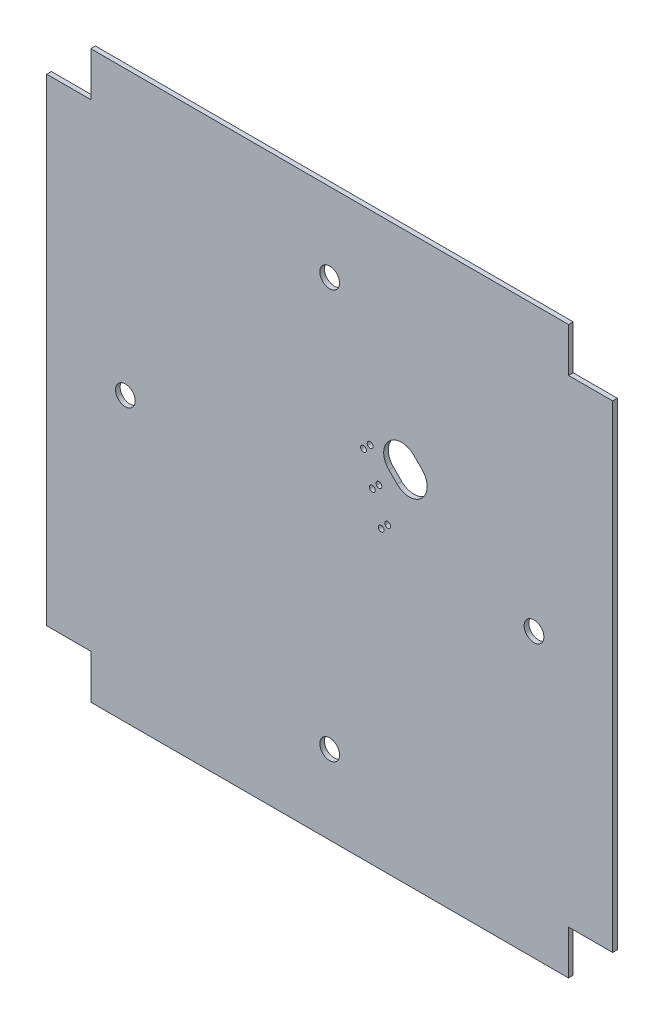
ISO-10303-21;
HEADER;
FILE_DESCRIPTION(('STEP AP214'),'2;1');
FILE_NAME('part.step','',(''),(''),'','','');
FILE_SCHEMA(('AUTOMOTIVE_DESIGN { 1 0 10303 214 1 1 1 1 }'));
ENDSEC;
DATA;
#1=APPLICATION_CONTEXT('core data for automotive mechanical design processes');
#2=APPLICATION_PROTOCOL_DEFINITION('international standard','automotive_design',2000,#1);
#3=PRODUCT_CONTEXT('',#1,'mechanical');
#4=PRODUCT('Part','Part','',(#3));
#5=PRODUCT_RELATED_PRODUCT_CATEGORY('part','',(#4));
#6=PRODUCT_DEFINITION_FORMATION('','',#4);
#7=PRODUCT_DEFINITION_CONTEXT('part definition',#1,'design');
#8=PRODUCT_DEFINITION('design','',#6,#7);
#9=PRODUCT_DEFINITION_SHAPE('','',#8);
#10=(LENGTH_UNIT() NAMED_UNIT(*) SI_UNIT(.MILLI.,.METRE.));
#11=(NAMED_UNIT(*) PLANE_ANGLE_UNIT() SI_UNIT($,.RADIAN.));
#12=(NAMED_UNIT(*) SI_UNIT($,.STERADIAN.) SOLID_ANGLE_UNIT());
#13=UNCERTAINTY_MEASURE_WITH_UNIT(LENGTH_MEASURE(1.E-05),#10,'distance_accuracy_value','');
#14=(GEOMETRIC_REPRESENTATION_CONTEXT(3) GLOBAL_UNCERTAINTY_ASSIGNED_CONTEXT((#13)) GLOBAL_UNIT_ASSIGNED_CONTEXT((#10,
#11,#12)) REPRESENTATION_CONTEXT('',''));
#15=CARTESIAN_POINT('',(0.,0.,0.));
#16=DIRECTION('',(0.,0.,1.));
#17=DIRECTION('',(1.,0.,0.));
#18=AXIS2_PLACEMENT_3D('',#15,#16,#17);
#19=CARTESIAN_POINT('',(48.75,48.75,0.8));
#20=DIRECTION('',(0.,-1.,0.));
#21=DIRECTION('',(1.,0.,0.));
#22=AXIS2_PLACEMENT_3D('',#19,#20,#21);
#23=PLANE('',#22);
#24=DIRECTION('',(-1.,0.,0.));
#25=VECTOR('',#24,1.);
#26=CARTESIAN_POINT('',(48.75,48.75,0.8));
#27=LINE('',#26,#25);
#28=CARTESIAN_POINT('',(41.15,48.75,0.8));
#29=VERTEX_POINT('',#28);
#30=CARTESIAN_POINT('',(-41.15,48.75,0.8));
#31=VERTEX_POINT('',#30);
#32=EDGE_CURVE('E217',#29,#31,#27,.T.);
#33=ORIENTED_EDGE('',*,*,#32,.F.);
#34=DIRECTION('',(0.,0.,-1.));
#35=VECTOR('',#34,1.);
#36=CARTESIAN_POINT('',(41.15,48.75,0.8));
#37=LINE('',#36,#35);
#38=CARTESIAN_POINT('',(41.15,48.75,0.));
#39=VERTEX_POINT('',#38);
#40=EDGE_CURVE('E316',#29,#39,#37,.T.);
#41=ORIENTED_EDGE('',*,*,#40,.T.);
#42=DIRECTION('',(-1.,0.,0.));
#43=VECTOR('',#42,1.);
#44=CARTESIAN_POINT('',(48.75,48.75,0.));
#45=LINE('',#44,#43);
#46=CARTESIAN_POINT('',(-41.15,48.75,0.));
#47=VERTEX_POINT('',#46);
#48=EDGE_CURVE('E207',#39,#47,#45,.T.);
#49=ORIENTED_EDGE('',*,*,#48,.T.);
#50=DIRECTION('',(0.,0.,-1.));
#51=VECTOR('',#50,1.);
#52=CARTESIAN_POINT('',(-41.15,48.75,0.8));
#53=LINE('',#52,#51);
#54=EDGE_CURVE('E357',#31,#47,#53,.T.);
#55=ORIENTED_EDGE('',*,*,#54,.F.);
#56=EDGE_LOOP('',(#33,#41,#49,#55));
#57=FACE_BOUND('',#56,.T.);
#58=ADVANCED_FACE('F32',(#57),#23,.F.);
#59=CARTESIAN_POINT('',(-48.75,-48.75,0.8));
#60=DIRECTION('',(-1.,0.,0.));
#61=DIRECTION('',(0.,0.,1.));
#62=AXIS2_PLACEMENT_3D('',#59,#60,#61);
#63=PLANE('',#62);
#64=DIRECTION('',(0.,0.,-1.));
#65=VECTOR('',#64,1.);
#66=CARTESIAN_POINT('',(-48.75,-41.15,0.8));
#67=LINE('',#66,#65);
#68=CARTESIAN_POINT('',(-48.75,-41.15,0.8));
#69=VERTEX_POINT('',#68);
#70=CARTESIAN_POINT('',(-48.75,-41.15,0.));
#71=VERTEX_POINT('',#70);
#72=EDGE_CURVE('E341',#69,#71,#67,.T.);
#73=ORIENTED_EDGE('',*,*,#72,.F.);
#74=DIRECTION('',(0.,1.,0.));
#75=VECTOR('',#74,1.);
#76=CARTESIAN_POINT('',(-48.75,-48.75,0.8));
#77=LINE('',#76,#75);
#78=CARTESIAN_POINT('',(-48.75,41.15,0.8));
#79=VERTEX_POINT('',#78);
#80=EDGE_CURVE('E203',#69,#79,#77,.T.);
#81=ORIENTED_EDGE('',*,*,#80,.T.);
#82=DIRECTION('',(0.,0.,-1.));
#83=VECTOR('',#82,1.);
#84=CARTESIAN_POINT('',(-48.75,41.15,0.8));
#85=LINE('',#84,#83);
#86=CARTESIAN_POINT('',(-48.75,41.15,0.));
#87=VERTEX_POINT('',#86);
#88=EDGE_CURVE('E211',#79,#87,#85,.T.);
#89=ORIENTED_EDGE('',*,*,#88,.T.);
#90=DIRECTION('',(0.,1.,0.));
#91=VECTOR('',#90,1.);
#92=CARTESIAN_POINT('',(-48.75,-48.75,0.));
#93=LINE('',#92,#91);
#94=EDGE_CURVE('E210',#71,#87,#93,.T.);
#95=ORIENTED_EDGE('',*,*,#94,.F.);
#96=EDGE_LOOP('',(#73,#81,#89,#95));
#97=FACE_BOUND('',#96,.T.);
#98=ADVANCED_FACE('F371',(#97),#63,.T.);
#99=CARTESIAN_POINT('',(48.75,-48.75,0.8));
#100=DIRECTION('',(0.,-1.,0.));
#101=DIRECTION('',(1.,0.,0.));
#102=AXIS2_PLACEMENT_3D('',#99,#100,#101);
#103=PLANE('',#102);
#104=DIRECTION('',(0.,0.,-1.));
#105=VECTOR('',#104,1.);
#106=CARTESIAN_POINT('',(-41.15,-48.75,0.8));
#107=LINE('',#106,#105);
#108=CARTESIAN_POINT('',(-41.15,-48.75,0.8));
#109=VERTEX_POINT('',#108);
#110=CARTESIAN_POINT('',(-41.15,-48.75,0.));
#111=VERTEX_POINT('',#110);
#112=EDGE_CURVE('E329',#109,#111,#107,.T.);
#113=ORIENTED_EDGE('',*,*,#112,.T.);
#114=DIRECTION('',(-1.,0.,0.));
#115=VECTOR('',#114,1.);
#116=CARTESIAN_POINT('',(48.75,-48.75,0.));
#117=LINE('',#116,#115);
#118=CARTESIAN_POINT('',(41.15,-48.75,0.));
#119=VERTEX_POINT('',#118);
#120=EDGE_CURVE('E214',#119,#111,#117,.T.);
#121=ORIENTED_EDGE('',*,*,#120,.F.);
#122=DIRECTION('',(0.,0.,-1.));
#123=VECTOR('',#122,1.);
#124=CARTESIAN_POINT('',(41.15,-48.75,0.8));
#125=LINE('',#124,#123);
#126=CARTESIAN_POINT('',(41.15,-48.75,0.8));
#127=VERTEX_POINT('',#126);
#128=EDGE_CURVE('E325',#127,#119,#125,.T.);
#129=ORIENTED_EDGE('',*,*,#128,.F.);
#130=DIRECTION('',(-1.,0.,0.));
#131=VECTOR('',#130,1.);
#132=CARTESIAN_POINT('',(48.75,-48.75,0.8));
#133=LINE('',#132,#131);
#134=EDGE_CURVE('E198',#127,#109,#133,.T.);
#135=ORIENTED_EDGE('',*,*,#134,.T.);
#136=EDGE_LOOP('',(#113,#121,#129,#135));
#137=FACE_BOUND('',#136,.T.);
#138=ADVANCED_FACE('F390',(#137),#103,.T.);
#139=CARTESIAN_POINT('',(48.75,-48.75,0.8));
#140=DIRECTION('',(-1.,0.,0.));
#141=DIRECTION('',(0.,0.,1.));
#142=AXIS2_PLACEMENT_3D('',#139,#140,#141);
#143=PLANE('',#142);
#144=DIRECTION('',(0.,1.,0.));
#145=VECTOR('',#144,1.);
#146=CARTESIAN_POINT('',(48.75,-48.75,0.8));
#147=LINE('',#146,#145);
#148=CARTESIAN_POINT('',(48.75,-41.15,0.8));
#149=VERTEX_POINT('',#148);
#150=CARTESIAN_POINT('',(48.75,41.15,0.8));
#151=VERTEX_POINT('',#150);
#152=EDGE_CURVE('E187',#149,#151,#147,.T.);
#153=ORIENTED_EDGE('',*,*,#152,.F.);
#154=DIRECTION('',(0.,0.,-1.));
#155=VECTOR('',#154,1.);
#156=CARTESIAN_POINT('',(48.75,-41.15,0.8));
#157=LINE('',#156,#155);
#158=CARTESIAN_POINT('',(48.75,-41.15,0.));
#159=VERTEX_POINT('',#158);
#160=EDGE_CURVE('E314',#149,#159,#157,.T.);
#161=ORIENTED_EDGE('',*,*,#160,.T.);
#162=DIRECTION('',(0.,1.,0.));
#163=VECTOR('',#162,1.);
#164=CARTESIAN_POINT('',(48.75,-48.75,0.));
#165=LINE('',#164,#163);
#166=CARTESIAN_POINT('',(48.75,41.15,0.));
#167=VERTEX_POINT('',#166);
#168=EDGE_CURVE('E189',#159,#167,#165,.T.);
#169=ORIENTED_EDGE('',*,*,#168,.T.);
#170=DIRECTION('',(0.,0.,-1.));
#171=VECTOR('',#170,1.);
#172=CARTESIAN_POINT('',(48.75,41.15,0.8));
#173=LINE('',#172,#171);
#174=EDGE_CURVE('E172',#151,#167,#173,.T.);
#175=ORIENTED_EDGE('',*,*,#174,.F.);
#176=EDGE_LOOP('',(#153,#161,#169,#175));
#177=FACE_BOUND('',#176,.T.);
#178=ADVANCED_FACE('F185',(#177),#143,.F.);
#179=CARTESIAN_POINT('',(0.,0.,0.8));
#180=DIRECTION('',(0.,0.,-1.));
#181=DIRECTION('',(-1.,0.,0.));
#182=AXIS2_PLACEMENT_3D('',#179,#180,#181);
#183=PLANE('',#182);
#184=CARTESIAN_POINT('',(6.96500179468776,13.6825162159599,0.8));
#185=DIRECTION('',(0.,0.,-1.));
#186=DIRECTION('',(-1.,0.,0.));
#187=AXIS2_PLACEMENT_3D('',#184,#185,#186);
#188=CIRCLE('',#187,0.500000000000002);
#189=CARTESIAN_POINT('',(6.46500179468776,13.6825162159599,0.8));
#190=VERTEX_POINT('',#189);
#191=EDGE_CURVE('E282',#190,#190,#188,.T.);
#192=ORIENTED_EDGE('',*,*,#191,.T.);
#193=EDGE_LOOP('',(#192));
#194=FACE_BOUND('',#193,.T.);
#195=CARTESIAN_POINT('',(7.35391052434037,7.35391052434032,0.8));
#196=DIRECTION('',(0.,0.,-1.));
#197=DIRECTION('',(-1.,0.,0.));
#198=AXIS2_PLACEMENT_3D('',#195,#196,#197);
#199=CIRCLE('',#198,0.500000000000002);
#200=CARTESIAN_POINT('',(6.85391052434036,7.35391052434032,0.8));
#201=VERTEX_POINT('',#200);
#202=EDGE_CURVE('E711',#201,#201,#199,.T.);
#203=ORIENTED_EDGE('',*,*,#202,.T.);
#204=EDGE_LOOP('',(#203));
#205=FACE_BOUND('',#204,.T.);
#206=CARTESIAN_POINT('',(8.48528137423884,8.4852813742388,0.8));
#207=DIRECTION('',(0.,0.,-1.));
#208=DIRECTION('',(-1.,0.,0.));
#209=AXIS2_PLACEMENT_3D('',#206,#207,#208);
#210=CIRCLE('',#209,0.500000000000001);
#211=CARTESIAN_POINT('',(7.98528137423884,8.4852813742388,0.8));
#212=VERTEX_POINT('',#211);
#213=EDGE_CURVE('E704',#212,#212,#210,.T.);
#214=ORIENTED_EDGE('',*,*,#213,.T.);
#215=EDGE_LOOP('',(#214));
#216=FACE_BOUND('',#215,.T.);
#217=CARTESIAN_POINT('',(10.0055609537899,3.28804653251768,0.8));
#218=DIRECTION('',(0.,0.,-1.));
#219=DIRECTION('',(-1.,0.,0.));
#220=AXIS2_PLACEMENT_3D('',#217,#218,#219);
#221=CIRCLE('',#220,0.500000000000001);
#222=CARTESIAN_POINT('',(9.50556095378992,3.28804653251768,0.8));
#223=VERTEX_POINT('',#222);
#224=EDGE_CURVE('E720',#223,#223,#221,.T.);
#225=ORIENTED_EDGE('',*,*,#224,.T.);
#226=EDGE_LOOP('',(#225));
#227=FACE_BOUND('',#226,.T.);
#228=CARTESIAN_POINT('',(5.83363094478929,12.5511453660614,0.8));
#229=DIRECTION('',(0.,0.,-1.));
#230=DIRECTION('',(-1.,0.,0.));
#231=AXIS2_PLACEMENT_3D('',#228,#229,#230);
#232=CIRCLE('',#231,0.500000000000002);
#233=CARTESIAN_POINT('',(5.33363094478929,12.5511453660614,0.8));
#234=VERTEX_POINT('',#233);
#235=EDGE_CURVE('E697',#234,#234,#232,.T.);
#236=ORIENTED_EDGE('',*,*,#235,.T.);
#237=EDGE_LOOP('',(#236));
#238=FACE_BOUND('',#237,.T.);
#239=CARTESIAN_POINT('',(8.87419010389144,2.1566756826192,0.8));
#240=DIRECTION('',(0.,0.,-1.));
#241=DIRECTION('',(-1.,0.,0.));
#242=AXIS2_PLACEMENT_3D('',#239,#240,#241);
#243=CIRCLE('',#242,0.500000000000001);
#244=CARTESIAN_POINT('',(8.37419010389144,2.1566756826192,0.8));
#245=VERTEX_POINT('',#244);
#246=EDGE_CURVE('E716',#245,#245,#243,.T.);
#247=ORIENTED_EDGE('',*,*,#246,.T.);
#248=EDGE_LOOP('',(#247));
#249=FACE_BOUND('',#248,.T.);
#250=DIRECTION('',(-0.707106781186547,0.707106781186547,0.));
#251=VECTOR('',#250,1.);
#252=CARTESIAN_POINT('',(13.7178715550193,8.06101730552687,0.8));
#253=LINE('',#252,#251);
#254=CARTESIAN_POINT('',(11.5965512114596,10.1823376490865,0.8));
#255=VERTEX_POINT('',#254);
#256=CARTESIAN_POINT('',(10.1823376490866,11.5965512114596,0.8));
#257=VERTEX_POINT('',#256);
#258=EDGE_CURVE('E269',#255,#257,#253,.T.);
#259=ORIENTED_EDGE('',*,*,#258,.T.);
#260=CARTESIAN_POINT('',(12.3036579926462,13.7178715550192,0.8));
#261=DIRECTION('',(0.,0.,-1.));
#262=DIRECTION('',(-1.,0.,0.));
#263=AXIS2_PLACEMENT_3D('',#260,#261,#262);
#264=CIRCLE('',#263,3.);
#265=CARTESIAN_POINT('',(10.1823376490866,15.8391918985789,0.8));
#266=VERTEX_POINT('',#265);
#267=EDGE_CURVE('E237',#257,#266,#264,.T.);
#268=ORIENTED_EDGE('',*,*,#267,.T.);
#269=DIRECTION('',(0.707106781186548,0.707106781186547,0.));
#270=VECTOR('',#269,1.);
#271=CARTESIAN_POINT('',(12.3743686707649,18.0312229202572,0.8));
#272=LINE('',#271,#270);
#273=CARTESIAN_POINT('',(10.2530483272052,15.9099025766975,0.8));
#274=VERTEX_POINT('',#273);
#275=EDGE_CURVE('E277',#266,#274,#272,.T.);
#276=ORIENTED_EDGE('',*,*,#275,.T.);
#277=CARTESIAN_POINT('',(12.3743686707648,13.7885822331379,0.8));
#278=DIRECTION('',(0.,0.,-1.));
#279=DIRECTION('',(-1.,0.,0.));
#280=AXIS2_PLACEMENT_3D('',#277,#278,#279);
#281=CIRCLE('',#280,3.);
#282=CARTESIAN_POINT('',(14.4956890143245,15.9099025766975,0.8));
#283=VERTEX_POINT('',#282);
#284=EDGE_CURVE('E11',#274,#283,#281,.T.);
#285=ORIENTED_EDGE('',*,*,#284,.T.);
#286=DIRECTION('',(0.707106781186545,-0.707106781186551,0.));
#287=VECTOR('',#286,1.);
#288=CARTESIAN_POINT('',(18.0312229202572,12.3743686707648,0.8));
#289=LINE('',#288,#287);
#290=CARTESIAN_POINT('',(15.9099025766976,14.4956890143244,0.8));
#291=VERTEX_POINT('',#290);
#292=EDGE_CURVE('E261',#283,#291,#289,.T.);
#293=ORIENTED_EDGE('',*,*,#292,.T.);
#294=CARTESIAN_POINT('',(13.7885822331379,12.3743686707648,0.8));
#295=DIRECTION('',(0.,0.,-1.));
#296=DIRECTION('',(-1.,0.,0.));
#297=AXIS2_PLACEMENT_3D('',#294,#295,#296);
#298=CIRCLE('',#297,3.);
#299=CARTESIAN_POINT('',(15.9099025766976,10.2530483272051,0.8));
#300=VERTEX_POINT('',#299);
#301=EDGE_CURVE('E245',#291,#300,#298,.T.);
#302=ORIENTED_EDGE('',*,*,#301,.T.);
#303=DIRECTION('',(-0.707106781186548,-0.707106781186547,0.));
#304=VECTOR('',#303,1.);
#305=CARTESIAN_POINT('',(18.0312229202572,12.3743686707648,0.8));
#306=LINE('',#305,#304);
#307=CARTESIAN_POINT('',(15.8391918985789,10.1823376490865,0.8));
#308=VERTEX_POINT('',#307);
#309=EDGE_CURVE('E266',#300,#308,#306,.T.);
#310=ORIENTED_EDGE('',*,*,#309,.T.);
#311=CARTESIAN_POINT('',(13.7178715550193,12.3036579926462,0.8));
#312=DIRECTION('',(0.,0.,-1.));
#313=DIRECTION('',(-1.,0.,0.));
#314=AXIS2_PLACEMENT_3D('',#311,#312,#313);
#315=CIRCLE('',#314,3.);
#316=EDGE_CURVE('E241',#308,#255,#315,.T.);
#317=ORIENTED_EDGE('',*,*,#316,.T.);
#318=EDGE_LOOP('',(#259,#268,#276,#285,#293,#302,#310,#317));
#319=FACE_BOUND('',#318,.T.);
#320=CARTESIAN_POINT('',(0.,35.2,0.8));
#321=DIRECTION('',(0.,0.,-1.));
#322=DIRECTION('',(-1.,0.,0.));
#323=AXIS2_PLACEMENT_3D('',#320,#321,#322);
#324=CIRCLE('',#323,1.7);
#325=CARTESIAN_POINT('',(-1.7,35.2,0.8));
#326=VERTEX_POINT('',#325);
#327=EDGE_CURVE('E287',#326,#326,#324,.T.);
#328=ORIENTED_EDGE('',*,*,#327,.T.);
#329=EDGE_LOOP('',(#328));
#330=FACE_BOUND('',#329,.T.);
#331=CARTESIAN_POINT('',(-35.2,0.,0.8));
#332=DIRECTION('',(0.,0.,-1.));
#333=DIRECTION('',(-1.,0.,0.));
#334=AXIS2_PLACEMENT_3D('',#331,#332,#333);
#335=CIRCLE('',#334,1.7);
#336=CARTESIAN_POINT('',(-36.9,0.,0.8));
#337=VERTEX_POINT('',#336);
#338=EDGE_CURVE('E294',#337,#337,#335,.T.);
#339=ORIENTED_EDGE('',*,*,#338,.T.);
#340=EDGE_LOOP('',(#339));
#341=FACE_BOUND('',#340,.T.);
#342=CARTESIAN_POINT('',(0.,-35.2,0.8));
#343=DIRECTION('',(0.,0.,-1.));
#344=DIRECTION('',(-1.,0.,0.));
#345=AXIS2_PLACEMENT_3D('',#342,#343,#344);
#346=CIRCLE('',#345,1.7);
#347=CARTESIAN_POINT('',(-1.7,-35.2,0.8));
#348=VERTEX_POINT('',#347);
#349=EDGE_CURVE('E300',#348,#348,#346,.T.);
#350=ORIENTED_EDGE('',*,*,#349,.T.);
#351=EDGE_LOOP('',(#350));
#352=FACE_BOUND('',#351,.T.);
#353=CARTESIAN_POINT('',(35.2,0.,0.8));
#354=DIRECTION('',(0.,0.,-1.));
#355=DIRECTION('',(-1.,0.,0.));
#356=AXIS2_PLACEMENT_3D('',#353,#354,#355);
#357=CIRCLE('',#356,1.7);
#358=CARTESIAN_POINT('',(33.5,0.,0.8));
#359=VERTEX_POINT('',#358);
#360=EDGE_CURVE('E306',#359,#359,#357,.T.);
#361=ORIENTED_EDGE('',*,*,#360,.T.);
#362=EDGE_LOOP('',(#361));
#363=FACE_BOUND('',#362,.T.);
#364=DIRECTION('',(1.,0.,0.));
#365=VECTOR('',#364,1.);
#366=CARTESIAN_POINT('',(-48.75,-41.15,0.8));
#367=LINE('',#366,#365);
#368=CARTESIAN_POINT('',(-41.15,-41.15,0.8));
#369=VERTEX_POINT('',#368);
#370=EDGE_CURVE('E335',#69,#369,#367,.T.);
#371=ORIENTED_EDGE('',*,*,#370,.T.);
#372=DIRECTION('',(0.,-1.,0.));
#373=VECTOR('',#372,1.);
#374=CARTESIAN_POINT('',(-41.15,-48.75,0.8));
#375=LINE('',#374,#373);
#376=EDGE_CURVE('E337',#369,#109,#375,.T.);
#377=ORIENTED_EDGE('',*,*,#376,.T.);
#378=ORIENTED_EDGE('',*,*,#134,.F.);
#379=DIRECTION('',(0.,1.,0.));
#380=VECTOR('',#379,1.);
#381=CARTESIAN_POINT('',(41.15,-48.75,0.8));
#382=LINE('',#381,#380);
#383=CARTESIAN_POINT('',(41.15,-41.15,0.8));
#384=VERTEX_POINT('',#383);
#385=EDGE_CURVE('E321',#127,#384,#382,.T.);
#386=ORIENTED_EDGE('',*,*,#385,.T.);
#387=DIRECTION('',(1.,0.,0.));
#388=VECTOR('',#387,1.);
#389=CARTESIAN_POINT('',(48.75,-41.15,0.8));
#390=LINE('',#389,#388);
#391=EDGE_CURVE('E196',#384,#149,#390,.T.);
#392=ORIENTED_EDGE('',*,*,#391,.T.);
#393=ORIENTED_EDGE('',*,*,#152,.T.);
#394=DIRECTION('',(-1.,0.,0.));
#395=VECTOR('',#394,1.);
#396=CARTESIAN_POINT('',(48.75,41.15,0.8));
#397=LINE('',#396,#395);
#398=CARTESIAN_POINT('',(41.15,41.15,0.8));
#399=VERTEX_POINT('',#398);
#400=EDGE_CURVE('E168',#151,#399,#397,.T.);
#401=ORIENTED_EDGE('',*,*,#400,.T.);
#402=DIRECTION('',(0.,1.,0.));
#403=VECTOR('',#402,1.);
#404=CARTESIAN_POINT('',(41.15,48.75,0.8));
#405=LINE('',#404,#403);
#406=EDGE_CURVE('E179',#399,#29,#405,.T.);
#407=ORIENTED_EDGE('',*,*,#406,.T.);
#408=ORIENTED_EDGE('',*,*,#32,.T.);
#409=DIRECTION('',(0.,-1.,0.));
#410=VECTOR('',#409,1.);
#411=CARTESIAN_POINT('',(-41.15,48.75,0.8));
#412=LINE('',#411,#410);
#413=CARTESIAN_POINT('',(-41.15,41.15,0.8));
#414=VERTEX_POINT('',#413);
#415=EDGE_CURVE('E350',#31,#414,#412,.T.);
#416=ORIENTED_EDGE('',*,*,#415,.T.);
#417=DIRECTION('',(-1.,0.,0.));
#418=VECTOR('',#417,1.);
#419=CARTESIAN_POINT('',(-48.75,41.15,0.8));
#420=LINE('',#419,#418);
#421=EDGE_CURVE('E353',#414,#79,#420,.T.);
#422=ORIENTED_EDGE('',*,*,#421,.T.);
#423=ORIENTED_EDGE('',*,*,#80,.F.);
#424=EDGE_LOOP('',(#371,#377,#378,#386,#392,#393,#401,#407,#408,#416,#422,#423));
#425=FACE_BOUND('',#424,.T.);
#426=ADVANCED_FACE('F193',(#194,#205,#216,#227,#238,#249,#319,#330,#341,#352,#363,#425),#183,.F.);
#427=CARTESIAN_POINT('',(0.,0.,0.));
#428=DIRECTION('',(0.,0.,-1.));
#429=DIRECTION('',(-1.,0.,0.));
#430=AXIS2_PLACEMENT_3D('',#427,#428,#429);
#431=PLANE('',#430);
#432=CARTESIAN_POINT('',(6.96500179468776,13.6825162159599,0.));
#433=DIRECTION('',(0.,0.,-1.));
#434=DIRECTION('',(-1.,0.,0.));
#435=AXIS2_PLACEMENT_3D('',#432,#433,#434);
#436=CIRCLE('',#435,0.500000000000002);
#437=CARTESIAN_POINT('',(6.46500179468776,13.6825162159599,0.));
#438=VERTEX_POINT('',#437);
#439=EDGE_CURVE('E696',#438,#438,#436,.T.);
#440=ORIENTED_EDGE('',*,*,#439,.F.);
#441=EDGE_LOOP('',(#440));
#442=FACE_BOUND('',#441,.T.);
#443=CARTESIAN_POINT('',(7.35391052434037,7.35391052434032,0.));
#444=DIRECTION('',(0.,0.,-1.));
#445=DIRECTION('',(-1.,0.,0.));
#446=AXIS2_PLACEMENT_3D('',#443,#444,#445);
#447=CIRCLE('',#446,0.500000000000002);
#448=CARTESIAN_POINT('',(6.85391052434036,7.35391052434032,0.));
#449=VERTEX_POINT('',#448);
#450=EDGE_CURVE('E714',#449,#449,#447,.T.);
#451=ORIENTED_EDGE('',*,*,#450,.F.);
#452=EDGE_LOOP('',(#451));
#453=FACE_BOUND('',#452,.T.);
#454=CARTESIAN_POINT('',(8.48528137423884,8.4852813742388,0.));
#455=DIRECTION('',(0.,0.,-1.));
#456=DIRECTION('',(-1.,0.,0.));
#457=AXIS2_PLACEMENT_3D('',#454,#455,#456);
#458=CIRCLE('',#457,0.500000000000001);
#459=CARTESIAN_POINT('',(7.98528137423884,8.4852813742388,0.));
#460=VERTEX_POINT('',#459);
#461=EDGE_CURVE('E708',#460,#460,#458,.T.);
#462=ORIENTED_EDGE('',*,*,#461,.F.);
#463=EDGE_LOOP('',(#462));
#464=FACE_BOUND('',#463,.T.);
#465=CARTESIAN_POINT('',(10.0055609537899,3.28804653251768,0.));
#466=DIRECTION('',(0.,0.,-1.));
#467=DIRECTION('',(-1.,0.,0.));
#468=AXIS2_PLACEMENT_3D('',#465,#466,#467);
#469=CIRCLE('',#468,0.500000000000001);
#470=CARTESIAN_POINT('',(9.50556095378992,3.28804653251768,0.));
#471=VERTEX_POINT('',#470);
#472=EDGE_CURVE('E707',#471,#471,#469,.T.);
#473=ORIENTED_EDGE('',*,*,#472,.F.);
#474=EDGE_LOOP('',(#473));
#475=FACE_BOUND('',#474,.T.);
#476=CARTESIAN_POINT('',(5.83363094478929,12.5511453660614,0.));
#477=DIRECTION('',(0.,0.,-1.));
#478=DIRECTION('',(-1.,0.,0.));
#479=AXIS2_PLACEMENT_3D('',#476,#477,#478);
#480=CIRCLE('',#479,0.500000000000002);
#481=CARTESIAN_POINT('',(5.33363094478929,12.5511453660614,0.));
#482=VERTEX_POINT('',#481);
#483=EDGE_CURVE('E701',#482,#482,#480,.T.);
#484=ORIENTED_EDGE('',*,*,#483,.F.);
#485=EDGE_LOOP('',(#484));
#486=FACE_BOUND('',#485,.T.);
#487=CARTESIAN_POINT('',(8.87419010389144,2.1566756826192,0.));
#488=DIRECTION('',(0.,0.,-1.));
#489=DIRECTION('',(-1.,0.,0.));
#490=AXIS2_PLACEMENT_3D('',#487,#488,#489);
#491=CIRCLE('',#490,0.500000000000001);
#492=CARTESIAN_POINT('',(8.37419010389144,2.1566756826192,0.));
#493=VERTEX_POINT('',#492);
#494=EDGE_CURVE('E272',#493,#493,#491,.T.);
#495=ORIENTED_EDGE('',*,*,#494,.F.);
#496=EDGE_LOOP('',(#495));
#497=FACE_BOUND('',#496,.T.);
#498=DIRECTION('',(0.707106781186545,-0.707106781186551,0.));
#499=VECTOR('',#498,1.);
#500=CARTESIAN_POINT('',(18.0312229202572,12.3743686707648,0.));
#501=LINE('',#500,#499);
#502=CARTESIAN_POINT('',(14.4956890143245,15.9099025766975,0.));
#503=VERTEX_POINT('',#502);
#504=CARTESIAN_POINT('',(15.9099025766976,14.4956890143244,0.));
#505=VERTEX_POINT('',#504);
#506=EDGE_CURVE('E253',#503,#505,#501,.T.);
#507=ORIENTED_EDGE('',*,*,#506,.F.);
#508=CARTESIAN_POINT('',(12.3743686707648,13.7885822331379,0.));
#509=DIRECTION('',(0.,0.,-1.));
#510=DIRECTION('',(-1.,0.,0.));
#511=AXIS2_PLACEMENT_3D('',#508,#509,#510);
#512=CIRCLE('',#511,3.);
#513=CARTESIAN_POINT('',(10.2530483272052,15.9099025766975,0.));
#514=VERTEX_POINT('',#513);
#515=EDGE_CURVE('E40',#503,#514,#512,.F.);
#516=ORIENTED_EDGE('',*,*,#515,.T.);
#517=DIRECTION('',(0.707106781186548,0.707106781186547,0.));
#518=VECTOR('',#517,1.);
#519=CARTESIAN_POINT('',(12.3743686707649,18.0312229202572,0.));
#520=LINE('',#519,#518);
#521=CARTESIAN_POINT('',(10.1823376490866,15.8391918985789,0.));
#522=VERTEX_POINT('',#521);
#523=EDGE_CURVE('E252',#522,#514,#520,.T.);
#524=ORIENTED_EDGE('',*,*,#523,.F.);
#525=CARTESIAN_POINT('',(12.3036579926462,13.7178715550192,0.));
#526=DIRECTION('',(0.,0.,-1.));
#527=DIRECTION('',(-1.,0.,0.));
#528=AXIS2_PLACEMENT_3D('',#525,#526,#527);
#529=CIRCLE('',#528,3.);
#530=CARTESIAN_POINT('',(10.1823376490866,11.5965512114596,0.));
#531=VERTEX_POINT('',#530);
#532=EDGE_CURVE('E235',#522,#531,#529,.F.);
#533=ORIENTED_EDGE('',*,*,#532,.T.);
#534=DIRECTION('',(-0.707106781186547,0.707106781186547,0.));
#535=VECTOR('',#534,1.);
#536=CARTESIAN_POINT('',(13.7178715550193,8.06101730552687,0.));
#537=LINE('',#536,#535);
#538=CARTESIAN_POINT('',(11.5965512114596,10.1823376490865,0.));
#539=VERTEX_POINT('',#538);
#540=EDGE_CURVE('E262',#539,#531,#537,.T.);
#541=ORIENTED_EDGE('',*,*,#540,.F.);
#542=CARTESIAN_POINT('',(13.7178715550193,12.3036579926462,0.));
#543=DIRECTION('',(0.,0.,-1.));
#544=DIRECTION('',(-1.,0.,0.));
#545=AXIS2_PLACEMENT_3D('',#542,#543,#544);
#546=CIRCLE('',#545,3.);
#547=CARTESIAN_POINT('',(15.8391918985789,10.1823376490865,0.));
#548=VERTEX_POINT('',#547);
#549=EDGE_CURVE('E239',#539,#548,#546,.F.);
#550=ORIENTED_EDGE('',*,*,#549,.T.);
#551=DIRECTION('',(-0.707106781186548,-0.707106781186547,0.));
#552=VECTOR('',#551,1.);
#553=CARTESIAN_POINT('',(18.0312229202572,12.3743686707648,0.));
#554=LINE('',#553,#552);
#555=CARTESIAN_POINT('',(15.9099025766976,10.2530483272051,0.));
#556=VERTEX_POINT('',#555);
#557=EDGE_CURVE('E281',#556,#548,#554,.T.);
#558=ORIENTED_EDGE('',*,*,#557,.F.);
#559=CARTESIAN_POINT('',(13.7885822331379,12.3743686707648,0.));
#560=DIRECTION('',(0.,0.,-1.));
#561=DIRECTION('',(-1.,0.,0.));
#562=AXIS2_PLACEMENT_3D('',#559,#560,#561);
#563=CIRCLE('',#562,3.);
#564=EDGE_CURVE('E243',#556,#505,#563,.F.);
#565=ORIENTED_EDGE('',*,*,#564,.T.);
#566=EDGE_LOOP('',(#507,#516,#524,#533,#541,#550,#558,#565));
#567=FACE_BOUND('',#566,.T.);
#568=CARTESIAN_POINT('',(0.,35.2,0.));
#569=DIRECTION('',(0.,0.,-1.));
#570=DIRECTION('',(-1.,0.,0.));
#571=AXIS2_PLACEMENT_3D('',#568,#569,#570);
#572=CIRCLE('',#571,1.7);
#573=CARTESIAN_POINT('',(-1.7,35.2,0.));
#574=VERTEX_POINT('',#573);
#575=EDGE_CURVE('E291',#574,#574,#572,.T.);
#576=ORIENTED_EDGE('',*,*,#575,.F.);
#577=EDGE_LOOP('',(#576));
#578=FACE_BOUND('',#577,.T.);
#579=CARTESIAN_POINT('',(-35.2,0.,0.));
#580=DIRECTION('',(0.,0.,-1.));
#581=DIRECTION('',(-1.,0.,0.));
#582=AXIS2_PLACEMENT_3D('',#579,#580,#581);
#583=CIRCLE('',#582,1.7);
#584=CARTESIAN_POINT('',(-36.9,0.,0.));
#585=VERTEX_POINT('',#584);
#586=EDGE_CURVE('E297',#585,#585,#583,.T.);
#587=ORIENTED_EDGE('',*,*,#586,.F.);
#588=EDGE_LOOP('',(#587));
#589=FACE_BOUND('',#588,.T.);
#590=CARTESIAN_POINT('',(0.,-35.2,0.));
#591=DIRECTION('',(0.,0.,-1.));
#592=DIRECTION('',(-1.,0.,0.));
#593=AXIS2_PLACEMENT_3D('',#590,#591,#592);
#594=CIRCLE('',#593,1.7);
#595=CARTESIAN_POINT('',(-1.7,-35.2,0.));
#596=VERTEX_POINT('',#595);
#597=EDGE_CURVE('E303',#596,#596,#594,.T.);
#598=ORIENTED_EDGE('',*,*,#597,.F.);
#599=EDGE_LOOP('',(#598));
#600=FACE_BOUND('',#599,.T.);
#601=CARTESIAN_POINT('',(35.2,0.,0.));
#602=DIRECTION('',(0.,0.,-1.));
#603=DIRECTION('',(-1.,0.,0.));
#604=AXIS2_PLACEMENT_3D('',#601,#602,#603);
#605=CIRCLE('',#604,1.7);
#606=CARTESIAN_POINT('',(33.5,0.,0.));
#607=VERTEX_POINT('',#606);
#608=EDGE_CURVE('E279',#607,#607,#605,.T.);
#609=ORIENTED_EDGE('',*,*,#608,.F.);
#610=EDGE_LOOP('',(#609));
#611=FACE_BOUND('',#610,.T.);
#612=DIRECTION('',(0.,-1.,0.));
#613=VECTOR('',#612,1.);
#614=CARTESIAN_POINT('',(-41.15,-48.75,0.));
#615=LINE('',#614,#613);
#616=CARTESIAN_POINT('',(-41.15,-41.15,0.));
#617=VERTEX_POINT('',#616);
#618=EDGE_CURVE('E338',#617,#111,#615,.T.);
#619=ORIENTED_EDGE('',*,*,#618,.F.);
#620=DIRECTION('',(1.,0.,0.));
#621=VECTOR('',#620,1.);
#622=CARTESIAN_POINT('',(-48.75,-41.15,0.));
#623=LINE('',#622,#621);
#624=EDGE_CURVE('E290',#71,#617,#623,.T.);
#625=ORIENTED_EDGE('',*,*,#624,.F.);
#626=ORIENTED_EDGE('',*,*,#94,.T.);
#627=DIRECTION('',(-1.,0.,0.));
#628=VECTOR('',#627,1.);
#629=CARTESIAN_POINT('',(-48.75,41.15,0.));
#630=LINE('',#629,#628);
#631=CARTESIAN_POINT('',(-41.15,41.15,0.));
#632=VERTEX_POINT('',#631);
#633=EDGE_CURVE('E354',#632,#87,#630,.T.);
#634=ORIENTED_EDGE('',*,*,#633,.F.);
#635=DIRECTION('',(0.,-1.,0.));
#636=VECTOR('',#635,1.);
#637=CARTESIAN_POINT('',(-41.15,48.75,0.));
#638=LINE('',#637,#636);
#639=EDGE_CURVE('E319',#47,#632,#638,.T.);
#640=ORIENTED_EDGE('',*,*,#639,.F.);
#641=ORIENTED_EDGE('',*,*,#48,.F.);
#642=DIRECTION('',(0.,1.,0.));
#643=VECTOR('',#642,1.);
#644=CARTESIAN_POINT('',(41.15,48.75,0.));
#645=LINE('',#644,#643);
#646=CARTESIAN_POINT('',(41.15,41.15,0.));
#647=VERTEX_POINT('',#646);
#648=EDGE_CURVE('E180',#647,#39,#645,.T.);
#649=ORIENTED_EDGE('',*,*,#648,.F.);
#650=DIRECTION('',(-1.,0.,0.));
#651=VECTOR('',#650,1.);
#652=CARTESIAN_POINT('',(48.75,41.15,0.));
#653=LINE('',#652,#651);
#654=EDGE_CURVE('E312',#167,#647,#653,.T.);
#655=ORIENTED_EDGE('',*,*,#654,.F.);
#656=ORIENTED_EDGE('',*,*,#168,.F.);
#657=DIRECTION('',(1.,0.,0.));
#658=VECTOR('',#657,1.);
#659=CARTESIAN_POINT('',(48.75,-41.15,0.));
#660=LINE('',#659,#658);
#661=CARTESIAN_POINT('',(41.15,-41.15,0.));
#662=VERTEX_POINT('',#661);
#663=EDGE_CURVE('E323',#662,#159,#660,.T.);
#664=ORIENTED_EDGE('',*,*,#663,.F.);
#665=DIRECTION('',(0.,1.,0.));
#666=VECTOR('',#665,1.);
#667=CARTESIAN_POINT('',(41.15,-48.75,0.));
#668=LINE('',#667,#666);
#669=EDGE_CURVE('E326',#119,#662,#668,.T.);
#670=ORIENTED_EDGE('',*,*,#669,.F.);
#671=ORIENTED_EDGE('',*,*,#120,.T.);
#672=EDGE_LOOP('',(#619,#625,#626,#634,#640,#641,#649,#655,#656,#664,#670,#671));
#673=FACE_BOUND('',#672,.T.);
#674=ADVANCED_FACE('F250',(#442,#453,#464,#475,#486,#497,#567,#578,#589,#600,#611,#673),#431,.T.);
#675=CARTESIAN_POINT('',(-48.75,41.15,0.8));
#676=DIRECTION('',(0.,-1.,0.));
#677=DIRECTION('',(0.,0.,-1.));
#678=AXIS2_PLACEMENT_3D('',#675,#676,#677);
#679=PLANE('',#678);
#680=ORIENTED_EDGE('',*,*,#633,.T.);
#681=ORIENTED_EDGE('',*,*,#88,.F.);
#682=ORIENTED_EDGE('',*,*,#421,.F.);
#683=DIRECTION('',(0.,0.,-1.));
#684=VECTOR('',#683,1.);
#685=CARTESIAN_POINT('',(-41.15,41.15,0.8));
#686=LINE('',#685,#684);
#687=EDGE_CURVE('E363',#414,#632,#686,.T.);
#688=ORIENTED_EDGE('',*,*,#687,.T.);
#689=EDGE_LOOP('',(#680,#681,#682,#688));
#690=FACE_BOUND('',#689,.T.);
#691=ADVANCED_FACE('F375',(#690),#679,.F.);
#692=CARTESIAN_POINT('',(-41.15,48.75,0.8));
#693=DIRECTION('',(1.,0.,0.));
#694=DIRECTION('',(0.,0.,-1.));
#695=AXIS2_PLACEMENT_3D('',#692,#693,#694);
#696=PLANE('',#695);
#697=ORIENTED_EDGE('',*,*,#639,.T.);
#698=ORIENTED_EDGE('',*,*,#687,.F.);
#699=ORIENTED_EDGE('',*,*,#415,.F.);
#700=ORIENTED_EDGE('',*,*,#54,.T.);
#701=EDGE_LOOP('',(#697,#698,#699,#700));
#702=FACE_BOUND('',#701,.T.);
#703=ADVANCED_FACE('F476',(#702),#696,.F.);
#704=CARTESIAN_POINT('',(41.15,48.75,0.8));
#705=DIRECTION('',(-1.,0.,0.));
#706=DIRECTION('',(0.,0.,1.));
#707=AXIS2_PLACEMENT_3D('',#704,#705,#706);
#708=PLANE('',#707);
#709=ORIENTED_EDGE('',*,*,#648,.T.);
#710=ORIENTED_EDGE('',*,*,#40,.F.);
#711=ORIENTED_EDGE('',*,*,#406,.F.);
#712=DIRECTION('',(0.,0.,-1.));
#713=VECTOR('',#712,1.);
#714=CARTESIAN_POINT('',(41.15,41.15,0.8));
#715=LINE('',#714,#713);
#716=EDGE_CURVE('E174',#399,#647,#715,.T.);
#717=ORIENTED_EDGE('',*,*,#716,.T.);
#718=EDGE_LOOP('',(#709,#710,#711,#717));
#719=FACE_BOUND('',#718,.T.);
#720=ADVANCED_FACE('F405',(#719),#708,.F.);
#721=CARTESIAN_POINT('',(48.75,41.15,0.8));
#722=DIRECTION('',(0.,-1.,0.));
#723=DIRECTION('',(1.,0.,0.));
#724=AXIS2_PLACEMENT_3D('',#721,#722,#723);
#725=PLANE('',#724);
#726=ORIENTED_EDGE('',*,*,#654,.T.);
#727=ORIENTED_EDGE('',*,*,#716,.F.);
#728=ORIENTED_EDGE('',*,*,#400,.F.);
#729=ORIENTED_EDGE('',*,*,#174,.T.);
#730=EDGE_LOOP('',(#726,#727,#728,#729));
#731=FACE_BOUND('',#730,.T.);
#732=ADVANCED_FACE('F171',(#731),#725,.F.);
#733=CARTESIAN_POINT('',(48.75,-41.15,0.8));
#734=DIRECTION('',(0.,1.,0.));
#735=DIRECTION('',(0.,0.,1.));
#736=AXIS2_PLACEMENT_3D('',#733,#734,#735);
#737=PLANE('',#736);
#738=ORIENTED_EDGE('',*,*,#663,.T.);
#739=ORIENTED_EDGE('',*,*,#160,.F.);
#740=ORIENTED_EDGE('',*,*,#391,.F.);
#741=DIRECTION('',(0.,0.,-1.));
#742=VECTOR('',#741,1.);
#743=CARTESIAN_POINT('',(41.15,-41.15,0.8));
#744=LINE('',#743,#742);
#745=EDGE_CURVE('E332',#384,#662,#744,.T.);
#746=ORIENTED_EDGE('',*,*,#745,.T.);
#747=EDGE_LOOP('',(#738,#739,#740,#746));
#748=FACE_BOUND('',#747,.T.);
#749=ADVANCED_FACE('F397',(#748),#737,.F.);
#750=CARTESIAN_POINT('',(41.15,-48.75,0.8));
#751=DIRECTION('',(-1.,0.,0.));
#752=DIRECTION('',(0.,0.,1.));
#753=AXIS2_PLACEMENT_3D('',#750,#751,#752);
#754=PLANE('',#753);
#755=ORIENTED_EDGE('',*,*,#669,.T.);
#756=ORIENTED_EDGE('',*,*,#745,.F.);
#757=ORIENTED_EDGE('',*,*,#385,.F.);
#758=ORIENTED_EDGE('',*,*,#128,.T.);
#759=EDGE_LOOP('',(#755,#756,#757,#758));
#760=FACE_BOUND('',#759,.T.);
#761=ADVANCED_FACE('F394',(#760),#754,.F.);
#762=CARTESIAN_POINT('',(-41.15,-48.75,0.8));
#763=DIRECTION('',(1.,0.,0.));
#764=DIRECTION('',(0.,1.,0.));
#765=AXIS2_PLACEMENT_3D('',#762,#763,#764);
#766=PLANE('',#765);
#767=ORIENTED_EDGE('',*,*,#618,.T.);
#768=ORIENTED_EDGE('',*,*,#112,.F.);
#769=ORIENTED_EDGE('',*,*,#376,.F.);
#770=DIRECTION('',(0.,0.,-1.));
#771=VECTOR('',#770,1.);
#772=CARTESIAN_POINT('',(-41.15,-41.15,0.8));
#773=LINE('',#772,#771);
#774=EDGE_CURVE('E347',#369,#617,#773,.T.);
#775=ORIENTED_EDGE('',*,*,#774,.T.);
#776=EDGE_LOOP('',(#767,#768,#769,#775));
#777=FACE_BOUND('',#776,.T.);
#778=ADVANCED_FACE('F386',(#777),#766,.F.);
#779=CARTESIAN_POINT('',(-48.75,-41.15,0.8));
#780=DIRECTION('',(0.,1.,0.));
#781=DIRECTION('',(-1.,0.,0.));
#782=AXIS2_PLACEMENT_3D('',#779,#780,#781);
#783=PLANE('',#782);
#784=ORIENTED_EDGE('',*,*,#624,.T.);
#785=ORIENTED_EDGE('',*,*,#774,.F.);
#786=ORIENTED_EDGE('',*,*,#370,.F.);
#787=ORIENTED_EDGE('',*,*,#72,.T.);
#788=EDGE_LOOP('',(#784,#785,#786,#787));
#789=FACE_BOUND('',#788,.T.);
#790=ADVANCED_FACE('F383',(#789),#783,.F.);
#791=CARTESIAN_POINT('',(35.2,0.,0.8));
#792=DIRECTION('',(0.,0.,-1.));
#793=DIRECTION('',(-1.,0.,0.));
#794=AXIS2_PLACEMENT_3D('',#791,#792,#793);
#795=CYLINDRICAL_SURFACE('',#794,1.7);
#796=ORIENTED_EDGE('',*,*,#360,.F.);
#797=EDGE_LOOP('',(#796));
#798=FACE_BOUND('',#797,.T.);
#799=ORIENTED_EDGE('',*,*,#608,.T.);
#800=EDGE_LOOP('',(#799));
#801=FACE_BOUND('',#800,.T.);
#802=ADVANCED_FACE('F470',(#798,#801),#795,.F.);
#803=CARTESIAN_POINT('',(0.,-35.2,0.8));
#804=DIRECTION('',(0.,0.,-1.));
#805=DIRECTION('',(-1.,0.,0.));
#806=AXIS2_PLACEMENT_3D('',#803,#804,#805);
#807=CYLINDRICAL_SURFACE('',#806,1.7);
#808=ORIENTED_EDGE('',*,*,#349,.F.);
#809=EDGE_LOOP('',(#808));
#810=FACE_BOUND('',#809,.T.);
#811=ORIENTED_EDGE('',*,*,#597,.T.);
#812=EDGE_LOOP('',(#811));
#813=FACE_BOUND('',#812,.T.);
#814=ADVANCED_FACE('F466',(#810,#813),#807,.F.);
#815=CARTESIAN_POINT('',(-35.2,0.,0.8));
#816=DIRECTION('',(0.,0.,-1.));
#817=DIRECTION('',(-1.,0.,0.));
#818=AXIS2_PLACEMENT_3D('',#815,#816,#817);
#819=CYLINDRICAL_SURFACE('',#818,1.7);
#820=ORIENTED_EDGE('',*,*,#338,.F.);
#821=EDGE_LOOP('',(#820));
#822=FACE_BOUND('',#821,.T.);
#823=ORIENTED_EDGE('',*,*,#586,.T.);
#824=EDGE_LOOP('',(#823));
#825=FACE_BOUND('',#824,.T.);
#826=ADVANCED_FACE('F462',(#822,#825),#819,.F.);
#827=CARTESIAN_POINT('',(0.,35.2,0.8));
#828=DIRECTION('',(0.,0.,-1.));
#829=DIRECTION('',(-1.,0.,0.));
#830=AXIS2_PLACEMENT_3D('',#827,#828,#829);
#831=CYLINDRICAL_SURFACE('',#830,1.7);
#832=ORIENTED_EDGE('',*,*,#327,.F.);
#833=EDGE_LOOP('',(#832));
#834=FACE_BOUND('',#833,.T.);
#835=ORIENTED_EDGE('',*,*,#575,.T.);
#836=EDGE_LOOP('',(#835));
#837=FACE_BOUND('',#836,.T.);
#838=ADVANCED_FACE('F459',(#834,#837),#831,.F.);
#839=CARTESIAN_POINT('',(18.0312229202572,12.3743686707648,0.8));
#840=DIRECTION('',(0.707106781186551,0.707106781186545,0.));
#841=DIRECTION('',(-0.707106781186545,0.707106781186551,0.));
#842=AXIS2_PLACEMENT_3D('',#839,#840,#841);
#843=PLANE('',#842);
#844=ORIENTED_EDGE('',*,*,#506,.T.);
#845=DIRECTION('',(0.,0.,-1.));
#846=VECTOR('',#845,1.);
#847=CARTESIAN_POINT('',(15.9099025766976,14.4956890143244,0.8));
#848=LINE('',#847,#846);
#849=EDGE_CURVE('E47',#505,#291,#848,.F.);
#850=ORIENTED_EDGE('',*,*,#849,.T.);
#851=ORIENTED_EDGE('',*,*,#292,.F.);
#852=DIRECTION('',(0.,0.,-1.));
#853=VECTOR('',#852,1.);
#854=CARTESIAN_POINT('',(14.4956890143245,15.9099025766975,0.));
#855=LINE('',#854,#853);
#856=EDGE_CURVE('E231',#283,#503,#855,.T.);
#857=ORIENTED_EDGE('',*,*,#856,.T.);
#858=EDGE_LOOP('',(#844,#850,#851,#857));
#859=FACE_BOUND('',#858,.T.);
#860=ADVANCED_FACE('F264',(#859),#843,.F.);
#861=CARTESIAN_POINT('',(12.3743686707649,18.0312229202572,0.8));
#862=DIRECTION('',(-0.707106781186547,0.707106781186548,0.));
#863=DIRECTION('',(-0.707106781186548,-0.707106781186547,0.));
#864=AXIS2_PLACEMENT_3D('',#861,#862,#863);
#865=PLANE('',#864);
#866=ORIENTED_EDGE('',*,*,#275,.F.);
#867=DIRECTION('',(0.,0.,-1.));
#868=VECTOR('',#867,1.);
#869=CARTESIAN_POINT('',(10.1823376490866,15.8391918985789,0.));
#870=LINE('',#869,#868);
#871=EDGE_CURVE('E200',#266,#522,#870,.T.);
#872=ORIENTED_EDGE('',*,*,#871,.T.);
#873=ORIENTED_EDGE('',*,*,#523,.T.);
#874=DIRECTION('',(0.,0.,-1.));
#875=VECTOR('',#874,1.);
#876=CARTESIAN_POINT('',(10.2530483272052,15.9099025766975,0.8));
#877=LINE('',#876,#875);
#878=EDGE_CURVE('E197',#514,#274,#877,.F.);
#879=ORIENTED_EDGE('',*,*,#878,.T.);
#880=EDGE_LOOP('',(#866,#872,#873,#879));
#881=FACE_BOUND('',#880,.T.);
#882=ADVANCED_FACE('F259',(#881),#865,.F.);
#883=CARTESIAN_POINT('',(13.7178715550193,8.06101730552687,0.8));
#884=DIRECTION('',(-0.707106781186548,-0.707106781186548,0.));
#885=DIRECTION('',(0.707106781186548,-0.707106781186548,0.));
#886=AXIS2_PLACEMENT_3D('',#883,#884,#885);
#887=PLANE('',#886);
#888=ORIENTED_EDGE('',*,*,#540,.T.);
#889=DIRECTION('',(0.,0.,-1.));
#890=VECTOR('',#889,1.);
#891=CARTESIAN_POINT('',(10.1823376490866,11.5965512114596,0.8));
#892=LINE('',#891,#890);
#893=EDGE_CURVE('E224',#531,#257,#892,.F.);
#894=ORIENTED_EDGE('',*,*,#893,.T.);
#895=ORIENTED_EDGE('',*,*,#258,.F.);
#896=DIRECTION('',(0.,0.,-1.));
#897=VECTOR('',#896,1.);
#898=CARTESIAN_POINT('',(11.5965512114596,10.1823376490865,0.));
#899=LINE('',#898,#897);
#900=EDGE_CURVE('E221',#255,#539,#899,.T.);
#901=ORIENTED_EDGE('',*,*,#900,.T.);
#902=EDGE_LOOP('',(#888,#894,#895,#901));
#903=FACE_BOUND('',#902,.T.);
#904=ADVANCED_FACE('F443',(#903),#887,.F.);
#905=CARTESIAN_POINT('',(18.0312229202572,12.3743686707648,0.8));
#906=DIRECTION('',(0.707106781186547,-0.707106781186548,0.));
#907=DIRECTION('',(0.707106781186548,0.707106781186547,0.));
#908=AXIS2_PLACEMENT_3D('',#905,#906,#907);
#909=PLANE('',#908);
#910=ORIENTED_EDGE('',*,*,#557,.T.);
#911=DIRECTION('',(0.,0.,-1.));
#912=VECTOR('',#911,1.);
#913=CARTESIAN_POINT('',(15.8391918985789,10.1823376490865,0.8));
#914=LINE('',#913,#912);
#915=EDGE_CURVE('E229',#548,#308,#914,.F.);
#916=ORIENTED_EDGE('',*,*,#915,.T.);
#917=ORIENTED_EDGE('',*,*,#309,.F.);
#918=DIRECTION('',(0.,0.,-1.));
#919=VECTOR('',#918,1.);
#920=CARTESIAN_POINT('',(15.9099025766976,10.2530483272051,0.));
#921=LINE('',#920,#919);
#922=EDGE_CURVE('E226',#300,#556,#921,.T.);
#923=ORIENTED_EDGE('',*,*,#922,.T.);
#924=EDGE_LOOP('',(#910,#916,#917,#923));
#925=FACE_BOUND('',#924,.T.);
#926=ADVANCED_FACE('F436',(#925),#909,.F.);
#927=CARTESIAN_POINT('',(8.87419010389144,2.1566756826192,0.8));
#928=DIRECTION('',(0.,0.,-1.));
#929=DIRECTION('',(-1.,0.,0.));
#930=AXIS2_PLACEMENT_3D('',#927,#928,#929);
#931=CYLINDRICAL_SURFACE('',#930,0.500000000000001);
#932=ORIENTED_EDGE('',*,*,#246,.F.);
#933=EDGE_LOOP('',(#932));
#934=FACE_BOUND('',#933,.T.);
#935=ORIENTED_EDGE('',*,*,#494,.T.);
#936=EDGE_LOOP('',(#935));
#937=FACE_BOUND('',#936,.T.);
#938=ADVANCED_FACE('F452',(#934,#937),#931,.F.);
#939=CARTESIAN_POINT('',(5.83363094478929,12.5511453660614,0.8));
#940=DIRECTION('',(0.,0.,-1.));
#941=DIRECTION('',(-1.,0.,0.));
#942=AXIS2_PLACEMENT_3D('',#939,#940,#941);
#943=CYLINDRICAL_SURFACE('',#942,0.500000000000002);
#944=ORIENTED_EDGE('',*,*,#235,.F.);
#945=EDGE_LOOP('',(#944));
#946=FACE_BOUND('',#945,.T.);
#947=ORIENTED_EDGE('',*,*,#483,.T.);
#948=EDGE_LOOP('',(#947));
#949=FACE_BOUND('',#948,.T.);
#950=ADVANCED_FACE('F598',(#946,#949),#943,.F.);
#951=CARTESIAN_POINT('',(10.0055609537899,3.28804653251768,0.8));
#952=DIRECTION('',(0.,0.,-1.));
#953=DIRECTION('',(-1.,0.,0.));
#954=AXIS2_PLACEMENT_3D('',#951,#952,#953);
#955=CYLINDRICAL_SURFACE('',#954,0.500000000000001);
#956=ORIENTED_EDGE('',*,*,#224,.F.);
#957=EDGE_LOOP('',(#956));
#958=FACE_BOUND('',#957,.T.);
#959=ORIENTED_EDGE('',*,*,#472,.T.);
#960=EDGE_LOOP('',(#959));
#961=FACE_BOUND('',#960,.T.);
#962=ADVANCED_FACE('F608',(#958,#961),#955,.F.);
#963=CARTESIAN_POINT('',(8.48528137423884,8.4852813742388,0.8));
#964=DIRECTION('',(0.,0.,-1.));
#965=DIRECTION('',(-1.,0.,0.));
#966=AXIS2_PLACEMENT_3D('',#963,#964,#965);
#967=CYLINDRICAL_SURFACE('',#966,0.500000000000001);
#968=ORIENTED_EDGE('',*,*,#213,.F.);
#969=EDGE_LOOP('',(#968));
#970=FACE_BOUND('',#969,.T.);
#971=ORIENTED_EDGE('',*,*,#461,.T.);
#972=EDGE_LOOP('',(#971));
#973=FACE_BOUND('',#972,.T.);
#974=ADVANCED_FACE('F618',(#970,#973),#967,.F.);
#975=CARTESIAN_POINT('',(7.35391052434037,7.35391052434032,0.8));
#976=DIRECTION('',(0.,0.,-1.));
#977=DIRECTION('',(-1.,0.,0.));
#978=AXIS2_PLACEMENT_3D('',#975,#976,#977);
#979=CYLINDRICAL_SURFACE('',#978,0.500000000000002);
#980=ORIENTED_EDGE('',*,*,#202,.F.);
#981=EDGE_LOOP('',(#980));
#982=FACE_BOUND('',#981,.T.);
#983=ORIENTED_EDGE('',*,*,#450,.T.);
#984=EDGE_LOOP('',(#983));
#985=FACE_BOUND('',#984,.T.);
#986=ADVANCED_FACE('F628',(#982,#985),#979,.F.);
#987=CARTESIAN_POINT('',(6.96500179468776,13.6825162159599,0.8));
#988=DIRECTION('',(0.,0.,-1.));
#989=DIRECTION('',(-1.,0.,0.));
#990=AXIS2_PLACEMENT_3D('',#987,#988,#989);
#991=CYLINDRICAL_SURFACE('',#990,0.500000000000002);
#992=ORIENTED_EDGE('',*,*,#191,.F.);
#993=EDGE_LOOP('',(#992));
#994=FACE_BOUND('',#993,.T.);
#995=ORIENTED_EDGE('',*,*,#439,.T.);
#996=EDGE_LOOP('',(#995));
#997=FACE_BOUND('',#996,.T.);
#998=ADVANCED_FACE('F421',(#994,#997),#991,.F.);
#999=CARTESIAN_POINT('',(12.3036579926462,13.7178715550192,0.8));
#1000=DIRECTION('',(0.,0.,1.));
#1001=DIRECTION('',(1.,0.,0.));
#1002=AXIS2_PLACEMENT_3D('',#999,#1000,#1001);
#1003=CYLINDRICAL_SURFACE('',#1002,3.);
#1004=ORIENTED_EDGE('',*,*,#267,.F.);
#1005=ORIENTED_EDGE('',*,*,#893,.F.);
#1006=ORIENTED_EDGE('',*,*,#532,.F.);
#1007=ORIENTED_EDGE('',*,*,#871,.F.);
#1008=EDGE_LOOP('',(#1004,#1005,#1006,#1007));
#1009=FACE_BOUND('',#1008,.T.);
#1010=ADVANCED_FACE('F417',(#1009),#1003,.F.);
#1011=CARTESIAN_POINT('',(13.7178715550193,12.3036579926462,0.8));
#1012=DIRECTION('',(0.,0.,1.));
#1013=DIRECTION('',(1.,0.,0.));
#1014=AXIS2_PLACEMENT_3D('',#1011,#1012,#1013);
#1015=CYLINDRICAL_SURFACE('',#1014,3.);
#1016=ORIENTED_EDGE('',*,*,#316,.F.);
#1017=ORIENTED_EDGE('',*,*,#915,.F.);
#1018=ORIENTED_EDGE('',*,*,#549,.F.);
#1019=ORIENTED_EDGE('',*,*,#900,.F.);
#1020=EDGE_LOOP('',(#1016,#1017,#1018,#1019));
#1021=FACE_BOUND('',#1020,.T.);
#1022=ADVANCED_FACE('F420',(#1021),#1015,.F.);
#1023=CARTESIAN_POINT('',(13.7885822331379,12.3743686707648,0.8));
#1024=DIRECTION('',(0.,0.,1.));
#1025=DIRECTION('',(1.,0.,0.));
#1026=AXIS2_PLACEMENT_3D('',#1023,#1024,#1025);
#1027=CYLINDRICAL_SURFACE('',#1026,3.);
#1028=ORIENTED_EDGE('',*,*,#301,.F.);
#1029=ORIENTED_EDGE('',*,*,#849,.F.);
#1030=ORIENTED_EDGE('',*,*,#564,.F.);
#1031=ORIENTED_EDGE('',*,*,#922,.F.);
#1032=EDGE_LOOP('',(#1028,#1029,#1030,#1031));
#1033=FACE_BOUND('',#1032,.T.);
#1034=ADVANCED_FACE('F424',(#1033),#1027,.F.);
#1035=CARTESIAN_POINT('',(12.3743686707648,13.7885822331379,0.8));
#1036=DIRECTION('',(0.,0.,1.));
#1037=DIRECTION('',(1.,0.,0.));
#1038=AXIS2_PLACEMENT_3D('',#1035,#1036,#1037);
#1039=CYLINDRICAL_SURFACE('',#1038,3.);
#1040=ORIENTED_EDGE('',*,*,#284,.F.);
#1041=ORIENTED_EDGE('',*,*,#878,.F.);
#1042=ORIENTED_EDGE('',*,*,#515,.F.);
#1043=ORIENTED_EDGE('',*,*,#856,.F.);
#1044=EDGE_LOOP('',(#1040,#1041,#1042,#1043));
#1045=FACE_BOUND('',#1044,.T.);
#1046=ADVANCED_FACE('F34',(#1045),#1039,.F.);
#1047=CLOSED_SHELL('',(#58,#98,#138,#178,#426,#674,#691,#703,#720,#732,#749,#761,#778,#790,#802,
#814,#826,#838,#860,#882,#904,#926,#938,#950,#962,#974,#986,#998,#1010,#1022,#1034,#1046));
#1048=MANIFOLD_SOLID_BREP('B2',#1047);
#1049=ADVANCED_BREP_SHAPE_REPRESENTATION('',(#18,#1048),#14);
#1050=SHAPE_DEFINITION_REPRESENTATION(#9,#1049);
ENDSEC;
END-ISO-10303-21;
